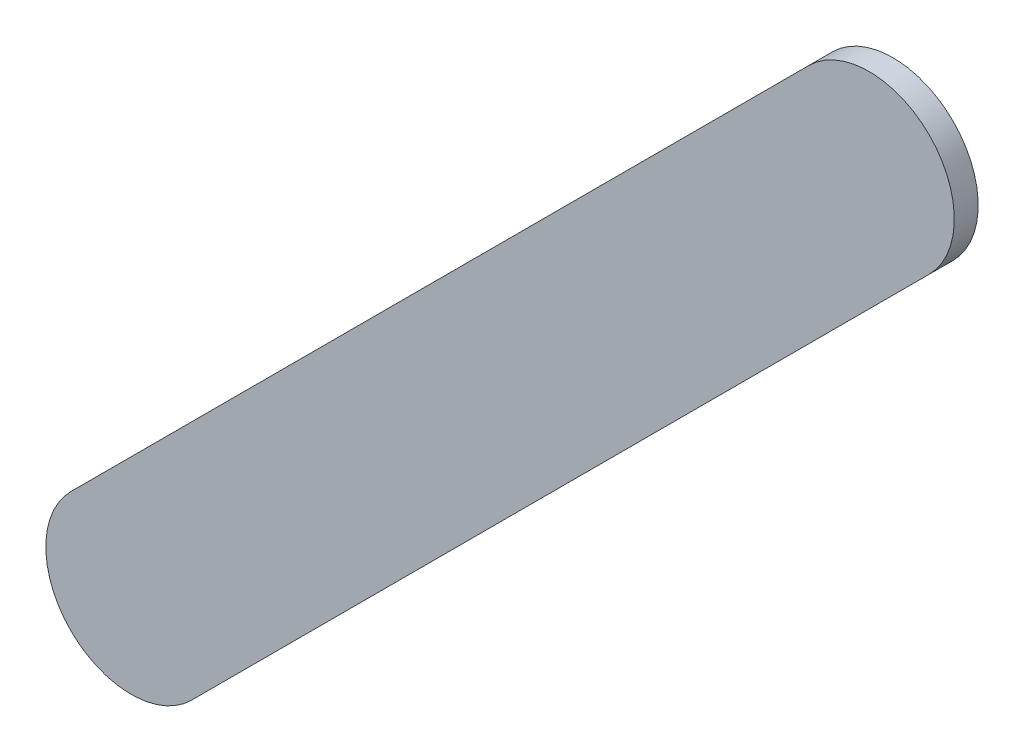
ISO-10303-21;
HEADER;
FILE_DESCRIPTION(('STEP AP214'),'2;1');
FILE_NAME('part.step','',(''),(''),'','','');
FILE_SCHEMA(('AUTOMOTIVE_DESIGN { 1 0 10303 214 1 1 1 1 }'));
ENDSEC;
DATA;
#1=APPLICATION_CONTEXT('core data for automotive mechanical design processes');
#2=APPLICATION_PROTOCOL_DEFINITION('international standard','automotive_design',2000,#1);
#3=PRODUCT_CONTEXT('',#1,'mechanical');
#4=PRODUCT('Part','Part','',(#3));
#5=PRODUCT_RELATED_PRODUCT_CATEGORY('part','',(#4));
#6=PRODUCT_DEFINITION_FORMATION('','',#4);
#7=PRODUCT_DEFINITION_CONTEXT('part definition',#1,'design');
#8=PRODUCT_DEFINITION('design','',#6,#7);
#9=PRODUCT_DEFINITION_SHAPE('','',#8);
#10=(LENGTH_UNIT() NAMED_UNIT(*) SI_UNIT(.MILLI.,.METRE.));
#11=(NAMED_UNIT(*) PLANE_ANGLE_UNIT() SI_UNIT($,.RADIAN.));
#12=(NAMED_UNIT(*) SI_UNIT($,.STERADIAN.) SOLID_ANGLE_UNIT());
#13=UNCERTAINTY_MEASURE_WITH_UNIT(LENGTH_MEASURE(1.E-05),#10,'distance_accuracy_value','');
#14=(GEOMETRIC_REPRESENTATION_CONTEXT(3) GLOBAL_UNCERTAINTY_ASSIGNED_CONTEXT((#13)) GLOBAL_UNIT_ASSIGNED_CONTEXT((#10,
#11,#12)) REPRESENTATION_CONTEXT('',''));
#15=CARTESIAN_POINT('',(0.,0.,0.));
#16=DIRECTION('',(0.,0.,1.));
#17=DIRECTION('',(1.,0.,0.));
#18=AXIS2_PLACEMENT_3D('',#15,#16,#17);
#19=CARTESIAN_POINT('',(75.60677538,93.69716846,0.));
#20=DIRECTION('',(-0.707107597571805,0.707105964800347,0.));
#21=DIRECTION('',(0.707105964800347,0.707107597571805,0.));
#22=AXIS2_PLACEMENT_3D('',#19,#20,#21);
#23=PLANE('',#22);
#24=DIRECTION('',(0.707105964800347,0.707107597571805,0.));
#25=VECTOR('',#24,1.);
#26=CARTESIAN_POINT('',(75.60677538,93.69716846,0.03556));
#27=LINE('',#26,#25);
#28=CARTESIAN_POINT('',(75.60677538,93.69716846,0.03556));
#29=VERTEX_POINT('',#28);
#30=CARTESIAN_POINT('',(76.70677572,94.79717134,0.03556));
#31=VERTEX_POINT('',#30);
#32=EDGE_CURVE('E11',#29,#31,#27,.T.);
#33=ORIENTED_EDGE('',*,*,#32,.F.);
#34=DIRECTION('',(0.,0.,1.));
#35=VECTOR('',#34,1.);
#36=CARTESIAN_POINT('',(75.60677538,93.69716846,0.));
#37=LINE('',#36,#35);
#38=CARTESIAN_POINT('',(75.60677538,93.69716846,0.));
#39=VERTEX_POINT('',#38);
#40=EDGE_CURVE('E24',#39,#29,#37,.T.);
#41=ORIENTED_EDGE('',*,*,#40,.F.);
#42=DIRECTION('',(0.707105964800347,0.707107597571805,0.));
#43=VECTOR('',#42,1.);
#44=CARTESIAN_POINT('',(75.60677538,93.69716846,0.));
#45=LINE('',#44,#43);
#46=CARTESIAN_POINT('',(76.70677572,94.79717134,0.));
#47=VERTEX_POINT('',#46);
#48=EDGE_CURVE('E75',#39,#47,#45,.T.);
#49=ORIENTED_EDGE('',*,*,#48,.T.);
#50=DIRECTION('',(0.,0.,1.));
#51=VECTOR('',#50,1.);
#52=CARTESIAN_POINT('',(76.70677572,94.79717134,0.));
#53=LINE('',#52,#51);
#54=EDGE_CURVE('E37',#47,#31,#53,.T.);
#55=ORIENTED_EDGE('',*,*,#54,.T.);
#56=EDGE_LOOP('',(#33,#41,#49,#55));
#57=FACE_BOUND('',#56,.T.);
#58=ADVANCED_FACE('F17',(#57),#23,.F.);
#59=CARTESIAN_POINT('',(76.61697402,94.88697304,0.));
#60=DIRECTION('',(0.,0.,-1.));
#61=DIRECTION('',(0.707106781186548,-0.707106781186548,0.));
#62=AXIS2_PLACEMENT_3D('',#59,#60,#61);
#63=CYLINDRICAL_SURFACE('',#62,0.126998782064153);
#64=CARTESIAN_POINT('',(76.61697402,94.88697304,0.03556));
#65=DIRECTION('',(0.,0.,1.));
#66=DIRECTION('',(0.707106781186548,-0.707106781186548,0.));
#67=AXIS2_PLACEMENT_3D('',#64,#65,#66);
#68=CIRCLE('',#67,0.126998782064153);
#69=CARTESIAN_POINT('',(76.52717232,94.97677474,0.03556));
#70=VERTEX_POINT('',#69);
#71=EDGE_CURVE('E83',#31,#70,#68,.T.);
#72=ORIENTED_EDGE('',*,*,#71,.F.);
#73=ORIENTED_EDGE('',*,*,#54,.F.);
#74=CARTESIAN_POINT('',(76.61697402,94.88697304,0.));
#75=DIRECTION('',(0.,0.,1.));
#76=DIRECTION('',(0.707106781186548,-0.707106781186548,0.));
#77=AXIS2_PLACEMENT_3D('',#74,#75,#76);
#78=CIRCLE('',#77,0.126998782064153);
#79=CARTESIAN_POINT('',(76.52717232,94.97677474,0.));
#80=VERTEX_POINT('',#79);
#81=EDGE_CURVE('E81',#47,#80,#78,.T.);
#82=ORIENTED_EDGE('',*,*,#81,.T.);
#83=DIRECTION('',(0.,0.,1.));
#84=VECTOR('',#83,1.);
#85=CARTESIAN_POINT('',(76.52717232,94.97677474,0.));
#86=LINE('',#85,#84);
#87=EDGE_CURVE('E67',#80,#70,#86,.T.);
#88=ORIENTED_EDGE('',*,*,#87,.T.);
#89=EDGE_LOOP('',(#72,#73,#82,#88));
#90=FACE_BOUND('',#89,.T.);
#91=ADVANCED_FACE('F89',(#90),#63,.T.);
#92=CARTESIAN_POINT('',(76.52717232,94.97677474,0.));
#93=DIRECTION('',(0.707105964800347,-0.707107597571805,0.));
#94=DIRECTION('',(-0.707107597571805,-0.707105964800347,0.));
#95=AXIS2_PLACEMENT_3D('',#92,#93,#94);
#96=PLANE('',#95);
#97=DIRECTION('',(-0.707107597571805,-0.707105964800347,0.));
#98=VECTOR('',#97,1.);
#99=CARTESIAN_POINT('',(76.52717232,94.97677474,0.03556));
#100=LINE('',#99,#98);
#101=CARTESIAN_POINT('',(75.42716944,93.8767744,0.03556));
#102=VERTEX_POINT('',#101);
#103=EDGE_CURVE('E71',#70,#102,#100,.T.);
#104=ORIENTED_EDGE('',*,*,#103,.F.);
#105=ORIENTED_EDGE('',*,*,#87,.F.);
#106=DIRECTION('',(-0.707107597571805,-0.707105964800347,0.));
#107=VECTOR('',#106,1.);
#108=CARTESIAN_POINT('',(76.52717232,94.97677474,0.));
#109=LINE('',#108,#107);
#110=CARTESIAN_POINT('',(75.42716944,93.8767744,0.));
#111=VERTEX_POINT('',#110);
#112=EDGE_CURVE('E63',#80,#111,#109,.T.);
#113=ORIENTED_EDGE('',*,*,#112,.T.);
#114=DIRECTION('',(0.,0.,1.));
#115=VECTOR('',#114,1.);
#116=CARTESIAN_POINT('',(75.42716944,93.8767744,0.));
#117=LINE('',#116,#115);
#118=EDGE_CURVE('E53',#111,#102,#117,.T.);
#119=ORIENTED_EDGE('',*,*,#118,.T.);
#120=EDGE_LOOP('',(#104,#105,#113,#119));
#121=FACE_BOUND('',#120,.T.);
#122=ADVANCED_FACE('F66',(#121),#96,.F.);
#123=CARTESIAN_POINT('',(75.51697241,93.78697143,0.));
#124=DIRECTION('',(0.,0.,-1.));
#125=DIRECTION('',(-0.707106781186604,0.707106781186492,0.));
#126=AXIS2_PLACEMENT_3D('',#123,#124,#125);
#127=CYLINDRICAL_SURFACE('',#126,0.127000578115389);
#128=CARTESIAN_POINT('',(75.51697241,93.78697143,0.03556));
#129=DIRECTION('',(0.,0.,1.));
#130=DIRECTION('',(-0.707106781186604,0.707106781186492,0.));
#131=AXIS2_PLACEMENT_3D('',#128,#129,#130);
#132=CIRCLE('',#131,0.127000578115389);
#133=EDGE_CURVE('E59',#102,#29,#132,.T.);
#134=ORIENTED_EDGE('',*,*,#133,.F.);
#135=ORIENTED_EDGE('',*,*,#118,.F.);
#136=CARTESIAN_POINT('',(75.51697241,93.78697143,0.));
#137=DIRECTION('',(0.,0.,1.));
#138=DIRECTION('',(-0.707106781186604,0.707106781186492,0.));
#139=AXIS2_PLACEMENT_3D('',#136,#137,#138);
#140=CIRCLE('',#139,0.127000578115389);
#141=EDGE_CURVE('E57',#111,#39,#140,.T.);
#142=ORIENTED_EDGE('',*,*,#141,.T.);
#143=ORIENTED_EDGE('',*,*,#40,.T.);
#144=EDGE_LOOP('',(#134,#135,#142,#143));
#145=FACE_BOUND('',#144,.T.);
#146=ADVANCED_FACE('F55',(#145),#127,.T.);
#147=CARTESIAN_POINT('',(75.60677538,93.69716846,0.));
#148=DIRECTION('',(0.,0.,-1.));
#149=DIRECTION('',(-1.,0.,0.));
#150=AXIS2_PLACEMENT_3D('',#147,#148,#149);
#151=PLANE('',#150);
#152=ORIENTED_EDGE('',*,*,#141,.F.);
#153=ORIENTED_EDGE('',*,*,#112,.F.);
#154=ORIENTED_EDGE('',*,*,#81,.F.);
#155=ORIENTED_EDGE('',*,*,#48,.F.);
#156=EDGE_LOOP('',(#152,#153,#154,#155));
#157=FACE_BOUND('',#156,.T.);
#158=ADVANCED_FACE('F74',(#157),#151,.T.);
#159=CARTESIAN_POINT('',(75.60677538,93.69716846,0.03556));
#160=DIRECTION('',(0.,0.,-1.));
#161=DIRECTION('',(-1.,0.,0.));
#162=AXIS2_PLACEMENT_3D('',#159,#160,#161);
#163=PLANE('',#162);
#164=ORIENTED_EDGE('',*,*,#32,.T.);
#165=ORIENTED_EDGE('',*,*,#71,.T.);
#166=ORIENTED_EDGE('',*,*,#103,.T.);
#167=ORIENTED_EDGE('',*,*,#133,.T.);
#168=EDGE_LOOP('',(#164,#165,#166,#167));
#169=FACE_BOUND('',#168,.T.);
#170=ADVANCED_FACE('F91',(#169),#163,.F.);
#171=CLOSED_SHELL('',(#58,#91,#122,#146,#158,#170));
#172=MANIFOLD_SOLID_BREP('B1',#171);
#173=ADVANCED_BREP_SHAPE_REPRESENTATION('',(#18,#172),#14);
#174=SHAPE_DEFINITION_REPRESENTATION(#9,#173);
ENDSEC;
END-ISO-10303-21;
